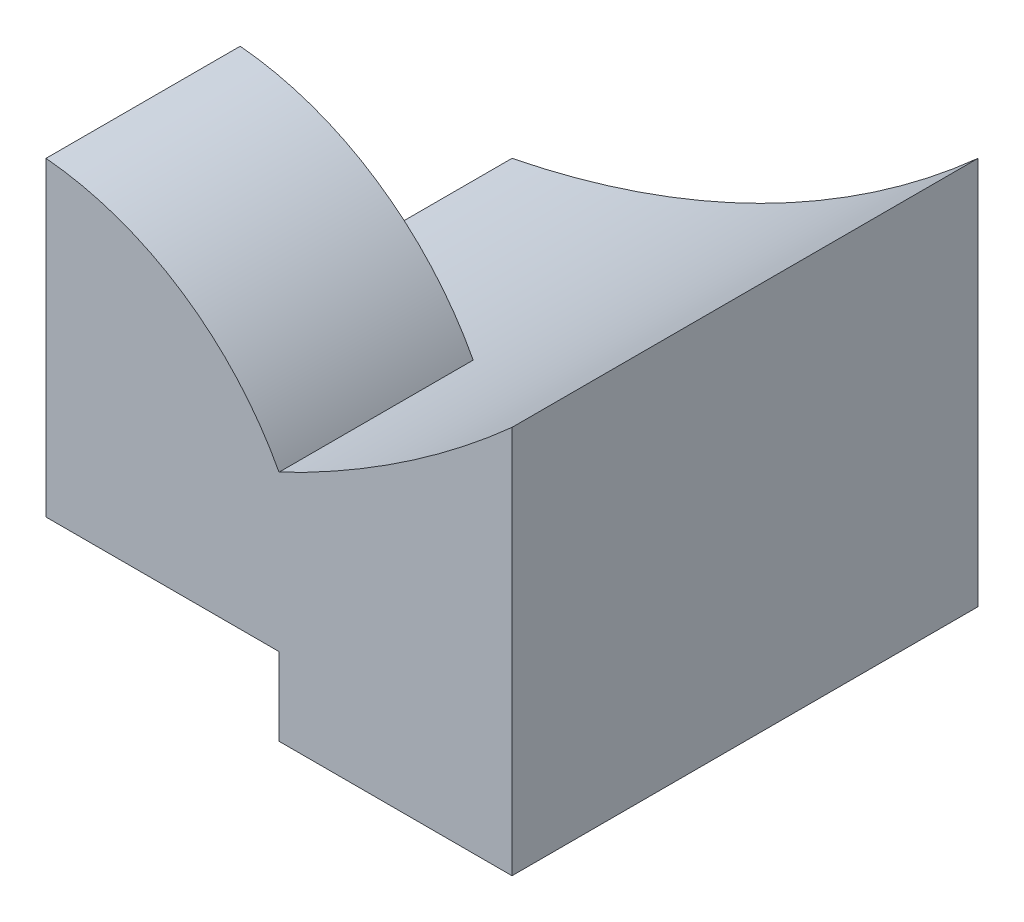
ISO-10303-21;
HEADER;
FILE_DESCRIPTION(('STEP AP214'),'2;1');
FILE_NAME('part.step','',(''),(''),'','','');
FILE_SCHEMA(('AUTOMOTIVE_DESIGN { 1 0 10303 214 1 1 1 1 }'));
ENDSEC;
DATA;
#1=APPLICATION_CONTEXT('core data for automotive mechanical design processes');
#2=APPLICATION_PROTOCOL_DEFINITION('international standard','automotive_design',2000,#1);
#3=PRODUCT_CONTEXT('',#1,'mechanical');
#4=PRODUCT('Part','Part','',(#3));
#5=PRODUCT_RELATED_PRODUCT_CATEGORY('part','',(#4));
#6=PRODUCT_DEFINITION_FORMATION('','',#4);
#7=PRODUCT_DEFINITION_CONTEXT('part definition',#1,'design');
#8=PRODUCT_DEFINITION('design','',#6,#7);
#9=PRODUCT_DEFINITION_SHAPE('','',#8);
#10=(LENGTH_UNIT() NAMED_UNIT(*) SI_UNIT(.MILLI.,.METRE.));
#11=(NAMED_UNIT(*) PLANE_ANGLE_UNIT() SI_UNIT($,.RADIAN.));
#12=(NAMED_UNIT(*) SI_UNIT($,.STERADIAN.) SOLID_ANGLE_UNIT());
#13=UNCERTAINTY_MEASURE_WITH_UNIT(LENGTH_MEASURE(1.E-05),#10,'distance_accuracy_value','');
#14=(GEOMETRIC_REPRESENTATION_CONTEXT(3) GLOBAL_UNCERTAINTY_ASSIGNED_CONTEXT((#13)) GLOBAL_UNIT_ASSIGNED_CONTEXT((#10,
#11,#12)) REPRESENTATION_CONTEXT('',''));
#15=CARTESIAN_POINT('',(0.,0.,0.));
#16=DIRECTION('',(0.,0.,1.));
#17=DIRECTION('',(1.,0.,0.));
#18=AXIS2_PLACEMENT_3D('',#15,#16,#17);
#19=CARTESIAN_POINT('',(-3.33668352664883,1.24497471002676,-9.5));
#20=DIRECTION('',(0.,0.,1.));
#21=DIRECTION('',(1.,0.,0.));
#22=AXIS2_PLACEMENT_3D('',#19,#20,#21);
#23=CYLINDRICAL_SURFACE('',#22,3.77008895458122);
#24=DIRECTION('',(0.,0.,1.));
#25=VECTOR('',#24,1.);
#26=CARTESIAN_POINT('',(0.,3.,-9.5));
#27=LINE('',#26,#25);
#28=CARTESIAN_POINT('',(0.,3.,0.5));
#29=VERTEX_POINT('',#28);
#30=CARTESIAN_POINT('',(0.,3.,3.));
#31=VERTEX_POINT('',#30);
#32=EDGE_CURVE('E146',#29,#31,#27,.T.);
#33=ORIENTED_EDGE('',*,*,#32,.F.);
#34=CARTESIAN_POINT('',(-3.33668352664883,1.24497471002676,0.5));
#35=DIRECTION('',(0.,0.,-1.));
#36=DIRECTION('',(-1.,0.,0.));
#37=AXIS2_PLACEMENT_3D('',#34,#35,#36);
#38=CIRCLE('',#37,3.77008895458122);
#39=CARTESIAN_POINT('',(-3.,5.,0.5));
#40=VERTEX_POINT('',#39);
#41=EDGE_CURVE('E56',#40,#29,#38,.T.);
#42=ORIENTED_EDGE('',*,*,#41,.F.);
#43=DIRECTION('',(0.,0.,1.));
#44=VECTOR('',#43,1.);
#45=CARTESIAN_POINT('',(-3.,5.,3.));
#46=LINE('',#45,#44);
#47=CARTESIAN_POINT('',(-3.,5.,3.));
#48=VERTEX_POINT('',#47);
#49=EDGE_CURVE('E153',#40,#48,#46,.T.);
#50=ORIENTED_EDGE('',*,*,#49,.T.);
#51=CARTESIAN_POINT('',(-3.33668352664883,1.24497471002676,3.));
#52=DIRECTION('',(0.,0.,1.));
#53=DIRECTION('',(1.,0.,0.));
#54=AXIS2_PLACEMENT_3D('',#51,#52,#53);
#55=CIRCLE('',#54,3.77008895458122);
#56=EDGE_CURVE('E140',#31,#48,#55,.T.);
#57=ORIENTED_EDGE('',*,*,#56,.F.);
#58=EDGE_LOOP('',(#33,#42,#50,#57));
#59=FACE_BOUND('',#58,.T.);
#60=ADVANCED_FACE('F33',(#59),#23,.T.);
#61=CARTESIAN_POINT('',(3.,5.,3.));
#62=DIRECTION('',(-1.,0.,0.));
#63=DIRECTION('',(0.,0.,1.));
#64=AXIS2_PLACEMENT_3D('',#61,#62,#63);
#65=PLANE('',#64);
#66=DIRECTION('',(0.,0.,-1.));
#67=VECTOR('',#66,1.);
#68=CARTESIAN_POINT('',(3.,0.,3.));
#69=LINE('',#68,#67);
#70=CARTESIAN_POINT('',(3.,0.,3.));
#71=VERTEX_POINT('',#70);
#72=CARTESIAN_POINT('',(3.,0.,-3.));
#73=VERTEX_POINT('',#72);
#74=EDGE_CURVE('E150',#71,#73,#69,.T.);
#75=ORIENTED_EDGE('',*,*,#74,.T.);
#76=DIRECTION('',(0.,-1.,0.));
#77=VECTOR('',#76,1.);
#78=CARTESIAN_POINT('',(3.,5.,-3.));
#79=LINE('',#78,#77);
#80=CARTESIAN_POINT('',(3.,5.,-3.));
#81=VERTEX_POINT('',#80);
#82=EDGE_CURVE('E11',#81,#73,#79,.T.);
#83=ORIENTED_EDGE('',*,*,#82,.F.);
#84=DIRECTION('',(0.,0.,-1.));
#85=VECTOR('',#84,1.);
#86=CARTESIAN_POINT('',(3.,5.,3.));
#87=LINE('',#86,#85);
#88=CARTESIAN_POINT('',(3.,5.,3.));
#89=VERTEX_POINT('',#88);
#90=EDGE_CURVE('E151',#89,#81,#87,.T.);
#91=ORIENTED_EDGE('',*,*,#90,.F.);
#92=DIRECTION('',(0.,-1.,0.));
#93=VECTOR('',#92,1.);
#94=CARTESIAN_POINT('',(3.,5.,3.));
#95=LINE('',#94,#93);
#96=EDGE_CURVE('E155',#89,#71,#95,.T.);
#97=ORIENTED_EDGE('',*,*,#96,.T.);
#98=EDGE_LOOP('',(#75,#83,#91,#97));
#99=FACE_BOUND('',#98,.T.);
#100=ADVANCED_FACE('F35',(#99),#65,.F.);
#101=CARTESIAN_POINT('',(-3.,5.,-3.));
#102=DIRECTION('',(0.,0.,1.));
#103=DIRECTION('',(1.,0.,0.));
#104=AXIS2_PLACEMENT_3D('',#101,#102,#103);
#105=PLANE('',#104);
#106=DIRECTION('',(0.,-1.,0.));
#107=VECTOR('',#106,1.);
#108=CARTESIAN_POINT('',(-3.,5.,-3.));
#109=LINE('',#108,#107);
#110=CARTESIAN_POINT('',(-3.,2.,-3.));
#111=VERTEX_POINT('',#110);
#112=CARTESIAN_POINT('',(-3.,0.,-3.));
#113=VERTEX_POINT('',#112);
#114=EDGE_CURVE('E41',#111,#113,#109,.T.);
#115=ORIENTED_EDGE('',*,*,#114,.F.);
#116=CARTESIAN_POINT('',(-5.5,14.5,-3.));
#117=DIRECTION('',(0.,0.,1.));
#118=DIRECTION('',(1.,0.,0.));
#119=AXIS2_PLACEMENT_3D('',#116,#117,#118);
#120=CIRCLE('',#119,12.747548783982);
#121=EDGE_CURVE('E148',#81,#111,#120,.F.);
#122=ORIENTED_EDGE('',*,*,#121,.F.);
#123=ORIENTED_EDGE('',*,*,#82,.T.);
#124=DIRECTION('',(-1.,0.,0.));
#125=VECTOR('',#124,1.);
#126=CARTESIAN_POINT('',(-3.,0.,-3.));
#127=LINE('',#126,#125);
#128=EDGE_CURVE('E158',#73,#113,#127,.T.);
#129=ORIENTED_EDGE('',*,*,#128,.T.);
#130=EDGE_LOOP('',(#115,#122,#123,#129));
#131=FACE_BOUND('',#130,.T.);
#132=ADVANCED_FACE('F174',(#131),#105,.F.);
#133=CARTESIAN_POINT('',(-3.,5.,3.));
#134=DIRECTION('',(1.,0.,0.));
#135=DIRECTION('',(0.,0.,-1.));
#136=AXIS2_PLACEMENT_3D('',#133,#134,#135);
#137=PLANE('',#136);
#138=DIRECTION('',(0.,-1.,0.));
#139=VECTOR('',#138,1.);
#140=CARTESIAN_POINT('',(-3.,0.,0.5));
#141=LINE('',#140,#139);
#142=CARTESIAN_POINT('',(-3.,1.,0.5));
#143=VERTEX_POINT('',#142);
#144=CARTESIAN_POINT('',(-3.,0.,0.5));
#145=VERTEX_POINT('',#144);
#146=EDGE_CURVE('E48',#143,#145,#141,.T.);
#147=ORIENTED_EDGE('',*,*,#146,.F.);
#148=DIRECTION('',(0.,0.,1.));
#149=VECTOR('',#148,1.);
#150=CARTESIAN_POINT('',(-3.,1.,0.5));
#151=LINE('',#150,#149);
#152=CARTESIAN_POINT('',(-3.,1.,3.));
#153=VERTEX_POINT('',#152);
#154=EDGE_CURVE('E127',#143,#153,#151,.T.);
#155=ORIENTED_EDGE('',*,*,#154,.T.);
#156=DIRECTION('',(0.,-1.,0.));
#157=VECTOR('',#156,1.);
#158=CARTESIAN_POINT('',(-3.,5.,3.));
#159=LINE('',#158,#157);
#160=EDGE_CURVE('E166',#48,#153,#159,.T.);
#161=ORIENTED_EDGE('',*,*,#160,.F.);
#162=ORIENTED_EDGE('',*,*,#49,.F.);
#163=DIRECTION('',(0.,1.,0.));
#164=VECTOR('',#163,1.);
#165=CARTESIAN_POINT('',(-3.,0.,0.5));
#166=LINE('',#165,#164);
#167=CARTESIAN_POINT('',(-3.,2.,0.5));
#168=VERTEX_POINT('',#167);
#169=EDGE_CURVE('E135',#168,#40,#166,.T.);
#170=ORIENTED_EDGE('',*,*,#169,.F.);
#171=DIRECTION('',(0.,0.,-1.));
#172=VECTOR('',#171,1.);
#173=CARTESIAN_POINT('',(-3.,2.,0.5));
#174=LINE('',#173,#172);
#175=EDGE_CURVE('E137',#168,#111,#174,.T.);
#176=ORIENTED_EDGE('',*,*,#175,.T.);
#177=ORIENTED_EDGE('',*,*,#114,.T.);
#178=DIRECTION('',(0.,0.,1.));
#179=VECTOR('',#178,1.);
#180=CARTESIAN_POINT('',(-3.,0.,3.));
#181=LINE('',#180,#179);
#182=EDGE_CURVE('E161',#113,#145,#181,.T.);
#183=ORIENTED_EDGE('',*,*,#182,.T.);
#184=EDGE_LOOP('',(#147,#155,#161,#162,#170,#176,#177,#183));
#185=FACE_BOUND('',#184,.T.);
#186=ADVANCED_FACE('F170',(#185),#137,.F.);
#187=CARTESIAN_POINT('',(-3.,5.,3.));
#188=DIRECTION('',(0.,0.,-1.));
#189=DIRECTION('',(-1.,0.,0.));
#190=AXIS2_PLACEMENT_3D('',#187,#188,#189);
#191=PLANE('',#190);
#192=ORIENTED_EDGE('',*,*,#160,.T.);
#193=DIRECTION('',(-1.,0.,0.));
#194=VECTOR('',#193,1.);
#195=CARTESIAN_POINT('',(-3.,1.,3.));
#196=LINE('',#195,#194);
#197=CARTESIAN_POINT('',(0.,1.,3.));
#198=VERTEX_POINT('',#197);
#199=EDGE_CURVE('E183',#198,#153,#196,.T.);
#200=ORIENTED_EDGE('',*,*,#199,.F.);
#201=DIRECTION('',(0.,1.,0.));
#202=VECTOR('',#201,1.);
#203=CARTESIAN_POINT('',(0.,0.,3.));
#204=LINE('',#203,#202);
#205=CARTESIAN_POINT('',(0.,0.,3.));
#206=VERTEX_POINT('',#205);
#207=EDGE_CURVE('E182',#206,#198,#204,.T.);
#208=ORIENTED_EDGE('',*,*,#207,.F.);
#209=DIRECTION('',(1.,0.,0.));
#210=VECTOR('',#209,1.);
#211=CARTESIAN_POINT('',(-3.,0.,3.));
#212=LINE('',#211,#210);
#213=EDGE_CURVE('E125',#206,#71,#212,.T.);
#214=ORIENTED_EDGE('',*,*,#213,.T.);
#215=ORIENTED_EDGE('',*,*,#96,.F.);
#216=CARTESIAN_POINT('',(-5.5,14.5,3.));
#217=DIRECTION('',(0.,0.,1.));
#218=DIRECTION('',(1.,0.,0.));
#219=AXIS2_PLACEMENT_3D('',#216,#217,#218);
#220=CIRCLE('',#219,12.747548783982);
#221=EDGE_CURVE('E143',#89,#31,#220,.F.);
#222=ORIENTED_EDGE('',*,*,#221,.T.);
#223=ORIENTED_EDGE('',*,*,#56,.T.);
#224=EDGE_LOOP('',(#192,#200,#208,#214,#215,#222,#223));
#225=FACE_BOUND('',#224,.T.);
#226=ADVANCED_FACE('F180',(#225),#191,.F.);
#227=CARTESIAN_POINT('',(0.,0.,0.));
#228=DIRECTION('',(0.,-1.,0.));
#229=DIRECTION('',(0.,0.,-1.));
#230=AXIS2_PLACEMENT_3D('',#227,#228,#229);
#231=PLANE('',#230);
#232=DIRECTION('',(0.,0.,1.));
#233=VECTOR('',#232,1.);
#234=CARTESIAN_POINT('',(0.,0.,0.5));
#235=LINE('',#234,#233);
#236=CARTESIAN_POINT('',(0.,0.,0.5));
#237=VERTEX_POINT('',#236);
#238=EDGE_CURVE('E110',#237,#206,#235,.T.);
#239=ORIENTED_EDGE('',*,*,#238,.F.);
#240=DIRECTION('',(1.,0.,0.));
#241=VECTOR('',#240,1.);
#242=CARTESIAN_POINT('',(-3.,0.,0.5));
#243=LINE('',#242,#241);
#244=EDGE_CURVE('E115',#145,#237,#243,.T.);
#245=ORIENTED_EDGE('',*,*,#244,.F.);
#246=ORIENTED_EDGE('',*,*,#182,.F.);
#247=ORIENTED_EDGE('',*,*,#128,.F.);
#248=ORIENTED_EDGE('',*,*,#74,.F.);
#249=ORIENTED_EDGE('',*,*,#213,.F.);
#250=EDGE_LOOP('',(#239,#245,#246,#247,#248,#249));
#251=FACE_BOUND('',#250,.T.);
#252=ADVANCED_FACE('F123',(#251),#231,.T.);
#253=CARTESIAN_POINT('',(-5.5,14.5,-9.5));
#254=DIRECTION('',(0.,0.,1.));
#255=DIRECTION('',(1.,0.,0.));
#256=AXIS2_PLACEMENT_3D('',#253,#254,#255);
#257=CYLINDRICAL_SURFACE('',#256,12.747548783982);
#258=ORIENTED_EDGE('',*,*,#121,.T.);
#259=ORIENTED_EDGE('',*,*,#175,.F.);
#260=CARTESIAN_POINT('',(-5.49999999999998,14.5,0.5));
#261=DIRECTION('',(0.,0.,-1.));
#262=DIRECTION('',(-1.,0.,0.));
#263=AXIS2_PLACEMENT_3D('',#260,#261,#262);
#264=CIRCLE('',#263,12.7475487839819);
#265=EDGE_CURVE('E133',#29,#168,#264,.T.);
#266=ORIENTED_EDGE('',*,*,#265,.F.);
#267=ORIENTED_EDGE('',*,*,#32,.T.);
#268=ORIENTED_EDGE('',*,*,#221,.F.);
#269=ORIENTED_EDGE('',*,*,#90,.T.);
#270=EDGE_LOOP('',(#258,#259,#266,#267,#268,#269));
#271=FACE_BOUND('',#270,.T.);
#272=ADVANCED_FACE('F195',(#271),#257,.F.);
#273=CARTESIAN_POINT('',(0.,0.,0.5));
#274=DIRECTION('',(0.,0.,-1.));
#275=DIRECTION('',(-1.,0.,0.));
#276=AXIS2_PLACEMENT_3D('',#273,#274,#275);
#277=PLANE('',#276);
#278=ORIENTED_EDGE('',*,*,#41,.T.);
#279=ORIENTED_EDGE('',*,*,#265,.T.);
#280=ORIENTED_EDGE('',*,*,#169,.T.);
#281=EDGE_LOOP('',(#278,#279,#280));
#282=FACE_BOUND('',#281,.T.);
#283=ADVANCED_FACE('F193',(#282),#277,.T.);
#284=CARTESIAN_POINT('',(-3.,1.,0.5));
#285=DIRECTION('',(0.,1.,0.));
#286=DIRECTION('',(0.,0.,1.));
#287=AXIS2_PLACEMENT_3D('',#284,#285,#286);
#288=PLANE('',#287);
#289=ORIENTED_EDGE('',*,*,#199,.T.);
#290=ORIENTED_EDGE('',*,*,#154,.F.);
#291=DIRECTION('',(-1.,0.,0.));
#292=VECTOR('',#291,1.);
#293=CARTESIAN_POINT('',(-3.,1.,0.5));
#294=LINE('',#293,#292);
#295=CARTESIAN_POINT('',(0.,1.,0.5));
#296=VERTEX_POINT('',#295);
#297=EDGE_CURVE('E114',#296,#143,#294,.T.);
#298=ORIENTED_EDGE('',*,*,#297,.F.);
#299=DIRECTION('',(0.,0.,1.));
#300=VECTOR('',#299,1.);
#301=CARTESIAN_POINT('',(0.,1.,0.5));
#302=LINE('',#301,#300);
#303=EDGE_CURVE('E112',#296,#198,#302,.T.);
#304=ORIENTED_EDGE('',*,*,#303,.T.);
#305=EDGE_LOOP('',(#289,#290,#298,#304));
#306=FACE_BOUND('',#305,.T.);
#307=ADVANCED_FACE('F202',(#306),#288,.F.);
#308=CARTESIAN_POINT('',(0.,0.,0.5));
#309=DIRECTION('',(1.,0.,0.));
#310=DIRECTION('',(0.,0.,-1.));
#311=AXIS2_PLACEMENT_3D('',#308,#309,#310);
#312=PLANE('',#311);
#313=ORIENTED_EDGE('',*,*,#207,.T.);
#314=ORIENTED_EDGE('',*,*,#303,.F.);
#315=DIRECTION('',(0.,1.,0.));
#316=VECTOR('',#315,1.);
#317=CARTESIAN_POINT('',(0.,0.,0.5));
#318=LINE('',#317,#316);
#319=EDGE_CURVE('E106',#237,#296,#318,.T.);
#320=ORIENTED_EDGE('',*,*,#319,.F.);
#321=ORIENTED_EDGE('',*,*,#238,.T.);
#322=EDGE_LOOP('',(#313,#314,#320,#321));
#323=FACE_BOUND('',#322,.T.);
#324=ADVANCED_FACE('F108',(#323),#312,.F.);
#325=CARTESIAN_POINT('',(0.,0.,0.5));
#326=DIRECTION('',(0.,0.,-1.));
#327=DIRECTION('',(-1.,0.,0.));
#328=AXIS2_PLACEMENT_3D('',#325,#326,#327);
#329=PLANE('',#328);
#330=ORIENTED_EDGE('',*,*,#146,.T.);
#331=ORIENTED_EDGE('',*,*,#244,.T.);
#332=ORIENTED_EDGE('',*,*,#319,.T.);
#333=ORIENTED_EDGE('',*,*,#297,.T.);
#334=EDGE_LOOP('',(#330,#331,#332,#333));
#335=FACE_BOUND('',#334,.T.);
#336=ADVANCED_FACE('F117',(#335),#329,.F.);
#337=CLOSED_SHELL('',(#60,#100,#132,#186,#226,#252,#272,#283,#307,#324,#336));
#338=MANIFOLD_SOLID_BREP('B2',#337);
#339=ADVANCED_BREP_SHAPE_REPRESENTATION('',(#18,#338),#14);
#340=SHAPE_DEFINITION_REPRESENTATION(#9,#339);
ENDSEC;
END-ISO-10303-21;
